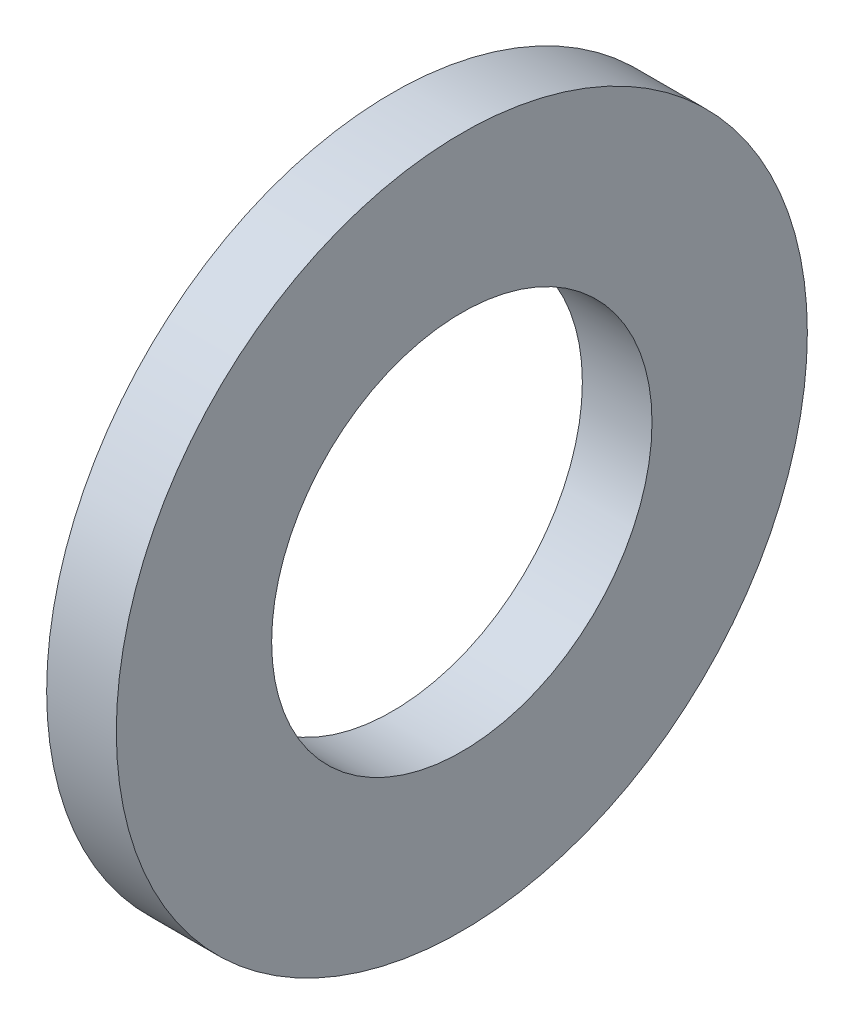
ISO-10303-21;
HEADER;
FILE_DESCRIPTION(('STEP AP214'),'2;1');
FILE_NAME('part.step','',(''),(''),'','','');
FILE_SCHEMA(('AUTOMOTIVE_DESIGN { 1 0 10303 214 1 1 1 1 }'));
ENDSEC;
DATA;
#1=APPLICATION_CONTEXT('core data for automotive mechanical design processes');
#2=APPLICATION_PROTOCOL_DEFINITION('international standard','automotive_design',2000,#1);
#3=PRODUCT_CONTEXT('',#1,'mechanical');
#4=PRODUCT('Part','Part','',(#3));
#5=PRODUCT_RELATED_PRODUCT_CATEGORY('part','',(#4));
#6=PRODUCT_DEFINITION_FORMATION('','',#4);
#7=PRODUCT_DEFINITION_CONTEXT('part definition',#1,'design');
#8=PRODUCT_DEFINITION('design','',#6,#7);
#9=PRODUCT_DEFINITION_SHAPE('','',#8);
#10=(LENGTH_UNIT() NAMED_UNIT(*) SI_UNIT(.MILLI.,.METRE.));
#11=(NAMED_UNIT(*) PLANE_ANGLE_UNIT() SI_UNIT($,.RADIAN.));
#12=(NAMED_UNIT(*) SI_UNIT($,.STERADIAN.) SOLID_ANGLE_UNIT());
#13=UNCERTAINTY_MEASURE_WITH_UNIT(LENGTH_MEASURE(1.E-05),#10,'distance_accuracy_value','');
#14=(GEOMETRIC_REPRESENTATION_CONTEXT(3) GLOBAL_UNCERTAINTY_ASSIGNED_CONTEXT((#13)) GLOBAL_UNIT_ASSIGNED_CONTEXT((#10,
#11,#12)) REPRESENTATION_CONTEXT('',''));
#15=CARTESIAN_POINT('',(0.,0.,0.));
#16=DIRECTION('',(0.,0.,1.));
#17=DIRECTION('',(1.,0.,0.));
#18=AXIS2_PLACEMENT_3D('',#15,#16,#17);
#19=CARTESIAN_POINT('',(-34.9249999999999,0.,0.));
#20=DIRECTION('',(-1.,0.,0.));
#21=DIRECTION('',(0.,0.,1.));
#22=AXIS2_PLACEMENT_3D('',#19,#20,#21);
#23=CYLINDRICAL_SURFACE('',#22,4.3688);
#24=CARTESIAN_POINT('',(0.,0.,0.));
#25=DIRECTION('',(-1.,0.,0.));
#26=DIRECTION('',(0.,0.,1.));
#27=AXIS2_PLACEMENT_3D('',#24,#25,#26);
#28=CIRCLE('',#27,4.3688);
#29=CARTESIAN_POINT('',(0.,0.,4.3688));
#30=VERTEX_POINT('',#29);
#31=EDGE_CURVE('E10',#30,#30,#28,.T.);
#32=ORIENTED_EDGE('',*,*,#31,.F.);
#33=EDGE_LOOP('',(#32));
#34=FACE_BOUND('',#33,.T.);
#35=CARTESIAN_POINT('',(-1.6002,0.,0.));
#36=DIRECTION('',(-1.,0.,0.));
#37=DIRECTION('',(0.,0.,1.));
#38=AXIS2_PLACEMENT_3D('',#35,#36,#37);
#39=CIRCLE('',#38,4.3688);
#40=CARTESIAN_POINT('',(-1.6002,0.,4.3688));
#41=VERTEX_POINT('',#40);
#42=EDGE_CURVE('E45',#41,#41,#39,.T.);
#43=ORIENTED_EDGE('',*,*,#42,.T.);
#44=EDGE_LOOP('',(#43));
#45=FACE_BOUND('',#44,.T.);
#46=ADVANCED_FACE('F31',(#34,#45),#23,.F.);
#47=CARTESIAN_POINT('',(0.,4.3688,0.));
#48=DIRECTION('',(-1.,0.,0.));
#49=DIRECTION('',(0.,0.,1.));
#50=AXIS2_PLACEMENT_3D('',#47,#48,#49);
#51=PLANE('',#50);
#52=CARTESIAN_POINT('',(0.,0.,0.));
#53=DIRECTION('',(-1.,0.,0.));
#54=DIRECTION('',(0.,0.,1.));
#55=AXIS2_PLACEMENT_3D('',#52,#53,#54);
#56=CIRCLE('',#55,7.9375);
#57=CARTESIAN_POINT('',(0.,0.,7.9375));
#58=VERTEX_POINT('',#57);
#59=EDGE_CURVE('E37',#58,#58,#56,.T.);
#60=ORIENTED_EDGE('',*,*,#59,.F.);
#61=EDGE_LOOP('',(#60));
#62=FACE_BOUND('',#61,.T.);
#63=ORIENTED_EDGE('',*,*,#31,.T.);
#64=EDGE_LOOP('',(#63));
#65=FACE_BOUND('',#64,.T.);
#66=ADVANCED_FACE('F60',(#62,#65),#51,.F.);
#67=CARTESIAN_POINT('',(-34.9249999999999,0.,0.));
#68=DIRECTION('',(-1.,0.,0.));
#69=DIRECTION('',(0.,0.,1.));
#70=AXIS2_PLACEMENT_3D('',#67,#68,#69);
#71=CYLINDRICAL_SURFACE('',#70,7.9375);
#72=CARTESIAN_POINT('',(-1.6002,0.,0.));
#73=DIRECTION('',(-1.,0.,0.));
#74=DIRECTION('',(0.,0.,1.));
#75=AXIS2_PLACEMENT_3D('',#72,#73,#74);
#76=CIRCLE('',#75,7.9375);
#77=CARTESIAN_POINT('',(-1.6002,0.,7.9375));
#78=VERTEX_POINT('',#77);
#79=EDGE_CURVE('E41',#78,#78,#76,.T.);
#80=ORIENTED_EDGE('',*,*,#79,.F.);
#81=EDGE_LOOP('',(#80));
#82=FACE_BOUND('',#81,.T.);
#83=ORIENTED_EDGE('',*,*,#59,.T.);
#84=EDGE_LOOP('',(#83));
#85=FACE_BOUND('',#84,.T.);
#86=ADVANCED_FACE('F55',(#82,#85),#71,.T.);
#87=CARTESIAN_POINT('',(-1.6002,7.9375,0.));
#88=DIRECTION('',(1.,0.,0.));
#89=DIRECTION('',(0.,0.,-1.));
#90=AXIS2_PLACEMENT_3D('',#87,#88,#89);
#91=PLANE('',#90);
#92=ORIENTED_EDGE('',*,*,#42,.F.);
#93=EDGE_LOOP('',(#92));
#94=FACE_BOUND('',#93,.T.);
#95=ORIENTED_EDGE('',*,*,#79,.T.);
#96=EDGE_LOOP('',(#95));
#97=FACE_BOUND('',#96,.T.);
#98=ADVANCED_FACE('F52',(#94,#97),#91,.F.);
#99=CLOSED_SHELL('',(#46,#66,#86,#98));
#100=MANIFOLD_SOLID_BREP('B2',#99);
#101=ADVANCED_BREP_SHAPE_REPRESENTATION('',(#18,#100),#14);
#102=SHAPE_DEFINITION_REPRESENTATION(#9,#101);
ENDSEC;
END-ISO-10303-21;
